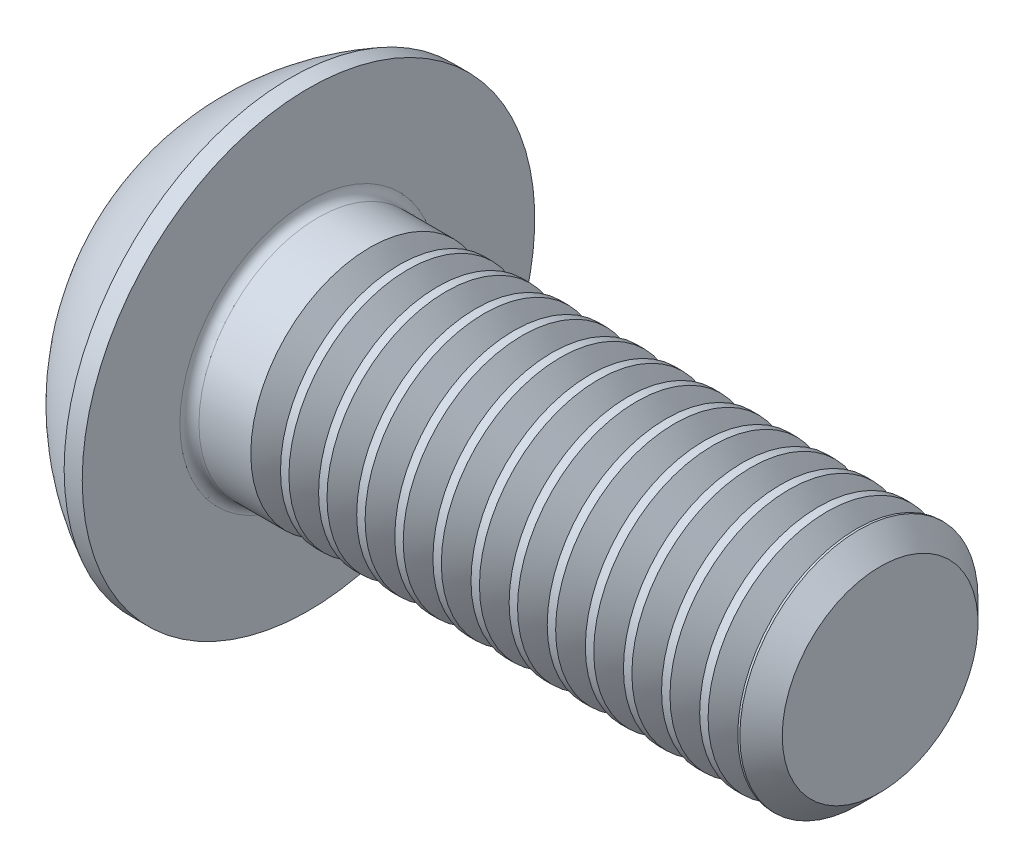
ISO-10303-21;
HEADER;
FILE_DESCRIPTION(('STEP AP214'),'2;1');
FILE_NAME('part.step','',(''),(''),'','','');
FILE_SCHEMA(('AUTOMOTIVE_DESIGN { 1 0 10303 214 1 1 1 1 }'));
ENDSEC;
DATA;
#1=APPLICATION_CONTEXT('core data for automotive mechanical design processes');
#2=APPLICATION_PROTOCOL_DEFINITION('international standard','automotive_design',2000,#1);
#3=PRODUCT_CONTEXT('',#1,'mechanical');
#4=PRODUCT('Part','Part','',(#3));
#5=PRODUCT_RELATED_PRODUCT_CATEGORY('part','',(#4));
#6=PRODUCT_DEFINITION_FORMATION('','',#4);
#7=PRODUCT_DEFINITION_CONTEXT('part definition',#1,'design');
#8=PRODUCT_DEFINITION('design','',#6,#7);
#9=PRODUCT_DEFINITION_SHAPE('','',#8);
#10=(LENGTH_UNIT() NAMED_UNIT(*) SI_UNIT(.MILLI.,.METRE.));
#11=(NAMED_UNIT(*) PLANE_ANGLE_UNIT() SI_UNIT($,.RADIAN.));
#12=(NAMED_UNIT(*) SI_UNIT($,.STERADIAN.) SOLID_ANGLE_UNIT());
#13=UNCERTAINTY_MEASURE_WITH_UNIT(LENGTH_MEASURE(1.E-05),#10,'distance_accuracy_value','');
#14=(GEOMETRIC_REPRESENTATION_CONTEXT(3) GLOBAL_UNCERTAINTY_ASSIGNED_CONTEXT((#13)) GLOBAL_UNIT_ASSIGNED_CONTEXT((#10,
#11,#12)) REPRESENTATION_CONTEXT('',''));
#15=CARTESIAN_POINT('',(0.,0.,0.));
#16=DIRECTION('',(0.,0.,1.));
#17=DIRECTION('',(1.,0.,0.));
#18=AXIS2_PLACEMENT_3D('',#15,#16,#17);
#19=CARTESIAN_POINT('',(0.,0.,0.));
#20=DIRECTION('',(-1.,0.,0.));
#21=DIRECTION('',(0.,0.,1.));
#22=AXIS2_PLACEMENT_3D('',#19,#20,#21);
#23=PLANE('',#22);
#24=CARTESIAN_POINT('',(0.,0.,0.));
#25=DIRECTION('',(-1.,0.,0.));
#26=DIRECTION('',(0.,0.,1.));
#27=AXIS2_PLACEMENT_3D('',#24,#25,#26);
#28=CIRCLE('',#27,2.375);
#29=CARTESIAN_POINT('',(0.,0.,2.375));
#30=VERTEX_POINT('',#29);
#31=EDGE_CURVE('E160',#30,#30,#28,.T.);
#32=ORIENTED_EDGE('',*,*,#31,.T.);
#33=EDGE_LOOP('',(#32));
#34=FACE_BOUND('',#33,.T.);
#35=DIRECTION('',(0.,-1.,0.));
#36=VECTOR('',#35,1.);
#37=CARTESIAN_POINT('',(0.,-0.866025403784438,1.5));
#38=LINE('',#37,#36);
#39=CARTESIAN_POINT('',(0.,0.866025403784439,1.5));
#40=VERTEX_POINT('',#39);
#41=CARTESIAN_POINT('',(0.,-0.866025403784438,1.5));
#42=VERTEX_POINT('',#41);
#43=EDGE_CURVE('E50',#40,#42,#38,.T.);
#44=ORIENTED_EDGE('',*,*,#43,.T.);
#45=DIRECTION('',(0.,-0.5,-0.866025403784439));
#46=VECTOR('',#45,1.);
#47=CARTESIAN_POINT('',(0.,-1.73205080756888,0.));
#48=LINE('',#47,#46);
#49=CARTESIAN_POINT('',(0.,-1.73205080756888,0.));
#50=VERTEX_POINT('',#49);
#51=EDGE_CURVE('E466',#42,#50,#48,.T.);
#52=ORIENTED_EDGE('',*,*,#51,.T.);
#53=DIRECTION('',(0.,0.5,-0.866025403784439));
#54=VECTOR('',#53,1.);
#55=CARTESIAN_POINT('',(0.,-0.866025403784438,-1.5));
#56=LINE('',#55,#54);
#57=CARTESIAN_POINT('',(0.,-0.866025403784438,-1.5));
#58=VERTEX_POINT('',#57);
#59=EDGE_CURVE('E135',#50,#58,#56,.T.);
#60=ORIENTED_EDGE('',*,*,#59,.T.);
#61=DIRECTION('',(0.,1.,0.));
#62=VECTOR('',#61,1.);
#63=CARTESIAN_POINT('',(0.,0.866025403784439,-1.5));
#64=LINE('',#63,#62);
#65=CARTESIAN_POINT('',(0.,0.866025403784439,-1.5));
#66=VERTEX_POINT('',#65);
#67=EDGE_CURVE('E484',#58,#66,#64,.T.);
#68=ORIENTED_EDGE('',*,*,#67,.T.);
#69=DIRECTION('',(0.,0.5,0.866025403784438));
#70=VECTOR('',#69,1.);
#71=CARTESIAN_POINT('',(0.,1.73205080756888,0.));
#72=LINE('',#71,#70);
#73=CARTESIAN_POINT('',(0.,1.73205080756888,0.));
#74=VERTEX_POINT('',#73);
#75=EDGE_CURVE('E486',#66,#74,#72,.T.);
#76=ORIENTED_EDGE('',*,*,#75,.T.);
#77=DIRECTION('',(0.,-0.5,0.866025403784438));
#78=VECTOR('',#77,1.);
#79=CARTESIAN_POINT('',(0.,0.866025403784439,1.5));
#80=LINE('',#79,#78);
#81=EDGE_CURVE('E488',#74,#40,#80,.T.);
#82=ORIENTED_EDGE('',*,*,#81,.T.);
#83=EDGE_LOOP('',(#44,#52,#60,#68,#76,#82));
#84=FACE_BOUND('',#83,.T.);
#85=ADVANCED_FACE('F35',(#34,#84),#23,.T.);
#86=CARTESIAN_POINT('',(4.75501582278481,0.,0.));
#87=DIRECTION('',(-1.,0.,0.));
#88=DIRECTION('',(0.,1.,0.));
#89=AXIS2_PLACEMENT_3D('',#86,#87,#88);
#90=SPHERICAL_SURFACE('',#89,5.3151482081814);
#91=CARTESIAN_POINT('',(2.37,0.,0.));
#92=DIRECTION('',(-1.,0.,0.));
#93=DIRECTION('',(0.,0.,1.));
#94=AXIS2_PLACEMENT_3D('',#91,#92,#93);
#95=CIRCLE('',#94,4.75);
#96=CARTESIAN_POINT('',(2.37,0.,4.75));
#97=VERTEX_POINT('',#96);
#98=EDGE_CURVE('E157',#97,#97,#95,.T.);
#99=ORIENTED_EDGE('',*,*,#98,.T.);
#100=EDGE_LOOP('',(#99));
#101=FACE_BOUND('',#100,.T.);
#102=ORIENTED_EDGE('',*,*,#31,.F.);
#103=EDGE_LOOP('',(#102));
#104=FACE_BOUND('',#103,.T.);
#105=ADVANCED_FACE('F182',(#101,#104),#90,.T.);
#106=CARTESIAN_POINT('',(0.,0.,0.));
#107=DIRECTION('',(-1.,0.,0.));
#108=DIRECTION('',(0.,0.,1.));
#109=AXIS2_PLACEMENT_3D('',#106,#107,#108);
#110=CYLINDRICAL_SURFACE('',#109,4.75);
#111=ORIENTED_EDGE('',*,*,#98,.F.);
#112=EDGE_LOOP('',(#111));
#113=FACE_BOUND('',#112,.T.);
#114=CARTESIAN_POINT('',(2.75,0.,0.));
#115=DIRECTION('',(-1.,0.,0.));
#116=DIRECTION('',(0.,0.,1.));
#117=AXIS2_PLACEMENT_3D('',#114,#115,#116);
#118=CIRCLE('',#117,4.75);
#119=CARTESIAN_POINT('',(2.75,0.,4.75));
#120=VERTEX_POINT('',#119);
#121=EDGE_CURVE('E154',#120,#120,#118,.T.);
#122=ORIENTED_EDGE('',*,*,#121,.T.);
#123=EDGE_LOOP('',(#122));
#124=FACE_BOUND('',#123,.T.);
#125=ADVANCED_FACE('F187',(#113,#124),#110,.T.);
#126=CARTESIAN_POINT('',(2.75,2.5,0.));
#127=DIRECTION('',(-1.,0.,0.));
#128=DIRECTION('',(0.,0.,1.));
#129=AXIS2_PLACEMENT_3D('',#126,#127,#128);
#130=PLANE('',#129);
#131=CARTESIAN_POINT('',(2.75,0.,0.));
#132=DIRECTION('',(-1.,0.,0.));
#133=DIRECTION('',(0.,0.,1.));
#134=AXIS2_PLACEMENT_3D('',#131,#132,#133);
#135=CIRCLE('',#134,2.7);
#136=CARTESIAN_POINT('',(2.75,0.,2.7));
#137=VERTEX_POINT('',#136);
#138=EDGE_CURVE('E43',#137,#137,#135,.T.);
#139=ORIENTED_EDGE('',*,*,#138,.T.);
#140=EDGE_LOOP('',(#139));
#141=FACE_BOUND('',#140,.T.);
#142=ORIENTED_EDGE('',*,*,#121,.F.);
#143=EDGE_LOOP('',(#142));
#144=FACE_BOUND('',#143,.T.);
#145=ADVANCED_FACE('F165',(#141,#144),#130,.F.);
#146=CARTESIAN_POINT('',(0.,0.,0.));
#147=DIRECTION('',(-1.,0.,0.));
#148=DIRECTION('',(0.,0.,1.));
#149=AXIS2_PLACEMENT_3D('',#146,#147,#148);
#150=CYLINDRICAL_SURFACE('',#149,2.5);
#151=CARTESIAN_POINT('',(4.03840764549667,0.,0.));
#152=DIRECTION('',(-1.,0.,0.));
#153=DIRECTION('',(0.,-1.,0.));
#154=AXIS2_PLACEMENT_3D('',#151,#152,#153);
#155=CIRCLE('',#154,2.5);
#156=CARTESIAN_POINT('',(4.03840764549667,-2.5,0.));
#157=VERTEX_POINT('',#156);
#158=EDGE_CURVE('E461',#157,#157,#155,.T.);
#159=ORIENTED_EDGE('',*,*,#158,.T.);
#160=EDGE_LOOP('',(#159));
#161=FACE_BOUND('',#160,.T.);
#162=CARTESIAN_POINT('',(2.95,0.,0.));
#163=DIRECTION('',(-1.,0.,0.));
#164=DIRECTION('',(0.,0.,1.));
#165=AXIS2_PLACEMENT_3D('',#162,#163,#164);
#166=CIRCLE('',#165,2.5);
#167=CARTESIAN_POINT('',(2.95,0.,2.5));
#168=VERTEX_POINT('',#167);
#169=EDGE_CURVE('E11',#168,#168,#166,.F.);
#170=ORIENTED_EDGE('',*,*,#169,.T.);
#171=EDGE_LOOP('',(#170));
#172=FACE_BOUND('',#171,.T.);
#173=ADVANCED_FACE('F169',(#161,#172),#150,.T.);
#174=CARTESIAN_POINT('',(2.95,0.,0.));
#175=DIRECTION('',(-1.,0.,0.));
#176=DIRECTION('',(0.,0.,1.));
#177=AXIS2_PLACEMENT_3D('',#174,#175,#176);
#178=TOROIDAL_SURFACE('',#177,2.7,0.2);
#179=ORIENTED_EDGE('',*,*,#169,.F.);
#180=EDGE_LOOP('',(#179));
#181=FACE_BOUND('',#180,.T.);
#182=ORIENTED_EDGE('',*,*,#138,.F.);
#183=EDGE_LOOP('',(#182));
#184=FACE_BOUND('',#183,.T.);
#185=ADVANCED_FACE('F37',(#181,#184),#178,.F.);
#186=CARTESIAN_POINT('',(1.56,-1.73205080756888,0.));
#187=DIRECTION('',(0.,0.866025403784438,-0.5));
#188=DIRECTION('',(0.,0.5,0.866025403784439));
#189=AXIS2_PLACEMENT_3D('',#186,#187,#188);
#190=PLANE('',#189);
#191=DIRECTION('',(0.,-0.5,-0.866025403784439));
#192=VECTOR('',#191,1.);
#193=CARTESIAN_POINT('',(1.56,-1.73205080756888,0.));
#194=LINE('',#193,#192);
#195=CARTESIAN_POINT('',(1.56,-0.866025403784438,1.5));
#196=VERTEX_POINT('',#195);
#197=CARTESIAN_POINT('',(1.56,-1.29903810567666,0.75));
#198=VERTEX_POINT('',#197);
#199=EDGE_CURVE('E118',#196,#198,#194,.T.);
#200=ORIENTED_EDGE('',*,*,#199,.T.);
#201=CARTESIAN_POINT('',(1.56,-1.73205080756888,0.));
#202=VERTEX_POINT('',#201);
#203=EDGE_CURVE('E111',#198,#202,#194,.T.);
#204=ORIENTED_EDGE('',*,*,#203,.T.);
#205=DIRECTION('',(-1.,0.,0.));
#206=VECTOR('',#205,1.);
#207=CARTESIAN_POINT('',(1.56,-1.73205080756888,0.));
#208=LINE('',#207,#206);
#209=EDGE_CURVE('E115',#202,#50,#208,.T.);
#210=ORIENTED_EDGE('',*,*,#209,.T.);
#211=ORIENTED_EDGE('',*,*,#51,.F.);
#212=DIRECTION('',(-1.,0.,0.));
#213=VECTOR('',#212,1.);
#214=CARTESIAN_POINT('',(1.56,-0.866025403784438,1.5));
#215=LINE('',#214,#213);
#216=EDGE_CURVE('E481',#196,#42,#215,.T.);
#217=ORIENTED_EDGE('',*,*,#216,.F.);
#218=EDGE_LOOP('',(#200,#204,#210,#211,#217));
#219=FACE_BOUND('',#218,.T.);
#220=ADVANCED_FACE('F113',(#219),#190,.T.);
#221=CARTESIAN_POINT('',(1.56,-0.866025403784438,-1.5));
#222=DIRECTION('',(0.,0.866025403784438,0.5));
#223=DIRECTION('',(0.,-0.5,0.866025403784439));
#224=AXIS2_PLACEMENT_3D('',#221,#222,#223);
#225=PLANE('',#224);
#226=DIRECTION('',(0.,0.5,-0.866025403784439));
#227=VECTOR('',#226,1.);
#228=CARTESIAN_POINT('',(1.56,-0.866025403784438,-1.5));
#229=LINE('',#228,#227);
#230=CARTESIAN_POINT('',(1.56,-1.29903810567666,-0.75));
#231=VERTEX_POINT('',#230);
#232=EDGE_CURVE('E123',#202,#231,#229,.T.);
#233=ORIENTED_EDGE('',*,*,#232,.T.);
#234=CARTESIAN_POINT('',(1.56,-0.866025403784438,-1.5));
#235=VERTEX_POINT('',#234);
#236=EDGE_CURVE('E130',#231,#235,#229,.T.);
#237=ORIENTED_EDGE('',*,*,#236,.T.);
#238=DIRECTION('',(-1.,0.,0.));
#239=VECTOR('',#238,1.);
#240=CARTESIAN_POINT('',(1.56,-0.866025403784438,-1.5));
#241=LINE('',#240,#239);
#242=EDGE_CURVE('E137',#235,#58,#241,.T.);
#243=ORIENTED_EDGE('',*,*,#242,.T.);
#244=ORIENTED_EDGE('',*,*,#59,.F.);
#245=ORIENTED_EDGE('',*,*,#209,.F.);
#246=EDGE_LOOP('',(#233,#237,#243,#244,#245));
#247=FACE_BOUND('',#246,.T.);
#248=ADVANCED_FACE('F133',(#247),#225,.T.);
#249=CARTESIAN_POINT('',(1.56,0.866025403784439,-1.5));
#250=DIRECTION('',(0.,0.,1.));
#251=DIRECTION('',(1.,0.,0.));
#252=AXIS2_PLACEMENT_3D('',#249,#250,#251);
#253=PLANE('',#252);
#254=DIRECTION('',(0.,1.,0.));
#255=VECTOR('',#254,1.);
#256=CARTESIAN_POINT('',(1.56,0.866025403784439,-1.5));
#257=LINE('',#256,#255);
#258=CARTESIAN_POINT('',(1.56,0.,-1.5));
#259=VERTEX_POINT('',#258);
#260=EDGE_CURVE('E468',#235,#259,#257,.T.);
#261=ORIENTED_EDGE('',*,*,#260,.T.);
#262=CARTESIAN_POINT('',(1.56,0.866025403784439,-1.5));
#263=VERTEX_POINT('',#262);
#264=EDGE_CURVE('E129',#259,#263,#257,.T.);
#265=ORIENTED_EDGE('',*,*,#264,.T.);
#266=DIRECTION('',(-1.,0.,0.));
#267=VECTOR('',#266,1.);
#268=CARTESIAN_POINT('',(1.56,0.866025403784439,-1.5));
#269=LINE('',#268,#267);
#270=EDGE_CURVE('E142',#263,#66,#269,.T.);
#271=ORIENTED_EDGE('',*,*,#270,.T.);
#272=ORIENTED_EDGE('',*,*,#67,.F.);
#273=ORIENTED_EDGE('',*,*,#242,.F.);
#274=EDGE_LOOP('',(#261,#265,#271,#272,#273));
#275=FACE_BOUND('',#274,.T.);
#276=ADVANCED_FACE('F213',(#275),#253,.T.);
#277=CARTESIAN_POINT('',(1.56,1.73205080756888,0.));
#278=DIRECTION('',(0.,-0.866025403784438,0.5));
#279=DIRECTION('',(0.,-0.5,-0.866025403784439));
#280=AXIS2_PLACEMENT_3D('',#277,#278,#279);
#281=PLANE('',#280);
#282=DIRECTION('',(0.,0.5,0.866025403784438));
#283=VECTOR('',#282,1.);
#284=CARTESIAN_POINT('',(1.56,1.73205080756888,0.));
#285=LINE('',#284,#283);
#286=CARTESIAN_POINT('',(1.56,1.29903810567666,-0.750000000000001));
#287=VERTEX_POINT('',#286);
#288=EDGE_CURVE('E472',#263,#287,#285,.T.);
#289=ORIENTED_EDGE('',*,*,#288,.T.);
#290=CARTESIAN_POINT('',(1.56,1.73205080756888,0.));
#291=VERTEX_POINT('',#290);
#292=EDGE_CURVE('E471',#287,#291,#285,.T.);
#293=ORIENTED_EDGE('',*,*,#292,.T.);
#294=DIRECTION('',(-1.,0.,0.));
#295=VECTOR('',#294,1.);
#296=CARTESIAN_POINT('',(1.56,1.73205080756888,0.));
#297=LINE('',#296,#295);
#298=EDGE_CURVE('E496',#291,#74,#297,.T.);
#299=ORIENTED_EDGE('',*,*,#298,.T.);
#300=ORIENTED_EDGE('',*,*,#75,.F.);
#301=ORIENTED_EDGE('',*,*,#270,.F.);
#302=EDGE_LOOP('',(#289,#293,#299,#300,#301));
#303=FACE_BOUND('',#302,.T.);
#304=ADVANCED_FACE('F216',(#303),#281,.T.);
#305=CARTESIAN_POINT('',(1.56,0.866025403784439,1.5));
#306=DIRECTION('',(0.,-0.866025403784438,-0.5));
#307=DIRECTION('',(0.,0.5,-0.866025403784439));
#308=AXIS2_PLACEMENT_3D('',#305,#306,#307);
#309=PLANE('',#308);
#310=DIRECTION('',(0.,-0.5,0.866025403784438));
#311=VECTOR('',#310,1.);
#312=CARTESIAN_POINT('',(1.56,0.866025403784439,1.5));
#313=LINE('',#312,#311);
#314=CARTESIAN_POINT('',(1.56,1.29903810567666,0.750000000000001));
#315=VERTEX_POINT('',#314);
#316=EDGE_CURVE('E476',#291,#315,#313,.T.);
#317=ORIENTED_EDGE('',*,*,#316,.T.);
#318=CARTESIAN_POINT('',(1.56,0.866025403784439,1.5));
#319=VERTEX_POINT('',#318);
#320=EDGE_CURVE('E475',#315,#319,#313,.T.);
#321=ORIENTED_EDGE('',*,*,#320,.T.);
#322=DIRECTION('',(-1.,0.,0.));
#323=VECTOR('',#322,1.);
#324=CARTESIAN_POINT('',(1.56,0.866025403784439,1.5));
#325=LINE('',#324,#323);
#326=EDGE_CURVE('E493',#319,#40,#325,.T.);
#327=ORIENTED_EDGE('',*,*,#326,.T.);
#328=ORIENTED_EDGE('',*,*,#81,.F.);
#329=ORIENTED_EDGE('',*,*,#298,.F.);
#330=EDGE_LOOP('',(#317,#321,#327,#328,#329));
#331=FACE_BOUND('',#330,.T.);
#332=ADVANCED_FACE('F220',(#331),#309,.T.);
#333=CARTESIAN_POINT('',(1.56,-0.866025403784438,1.5));
#334=DIRECTION('',(0.,0.,-1.));
#335=DIRECTION('',(-1.,0.,0.));
#336=AXIS2_PLACEMENT_3D('',#333,#334,#335);
#337=PLANE('',#336);
#338=DIRECTION('',(0.,-1.,0.));
#339=VECTOR('',#338,1.);
#340=CARTESIAN_POINT('',(1.56,-0.866025403784438,1.5));
#341=LINE('',#340,#339);
#342=CARTESIAN_POINT('',(1.56,0.,1.5));
#343=VERTEX_POINT('',#342);
#344=EDGE_CURVE('E58',#319,#343,#341,.T.);
#345=ORIENTED_EDGE('',*,*,#344,.T.);
#346=EDGE_CURVE('E479',#343,#196,#341,.T.);
#347=ORIENTED_EDGE('',*,*,#346,.T.);
#348=ORIENTED_EDGE('',*,*,#216,.T.);
#349=ORIENTED_EDGE('',*,*,#43,.F.);
#350=ORIENTED_EDGE('',*,*,#326,.F.);
#351=EDGE_LOOP('',(#345,#347,#348,#349,#350));
#352=FACE_BOUND('',#351,.T.);
#353=ADVANCED_FACE('F224',(#352),#337,.T.);
#354=CARTESIAN_POINT('',(1.56,0.,3.));
#355=DIRECTION('',(-1.,0.,0.));
#356=DIRECTION('',(0.,0.,1.));
#357=AXIS2_PLACEMENT_3D('',#354,#355,#356);
#358=PLANE('',#357);
#359=ORIENTED_EDGE('',*,*,#344,.F.);
#360=ORIENTED_EDGE('',*,*,#320,.F.);
#361=CARTESIAN_POINT('',(1.56,0.,0.));
#362=DIRECTION('',(-1.,0.,0.));
#363=DIRECTION('',(0.,0.,1.));
#364=AXIS2_PLACEMENT_3D('',#361,#362,#363);
#365=CIRCLE('',#364,1.5);
#366=EDGE_CURVE('E141',#343,#315,#365,.T.);
#367=ORIENTED_EDGE('',*,*,#366,.F.);
#368=EDGE_LOOP('',(#359,#360,#367));
#369=FACE_BOUND('',#368,.T.);
#370=ADVANCED_FACE('F228',(#369),#358,.T.);
#371=ORIENTED_EDGE('',*,*,#316,.F.);
#372=ORIENTED_EDGE('',*,*,#292,.F.);
#373=EDGE_CURVE('E148',#315,#287,#365,.T.);
#374=ORIENTED_EDGE('',*,*,#373,.F.);
#375=EDGE_LOOP('',(#371,#372,#374));
#376=FACE_BOUND('',#375,.T.);
#377=ADVANCED_FACE('F522',(#376),#358,.T.);
#378=ORIENTED_EDGE('',*,*,#288,.F.);
#379=ORIENTED_EDGE('',*,*,#264,.F.);
#380=EDGE_CURVE('E512',#287,#259,#365,.T.);
#381=ORIENTED_EDGE('',*,*,#380,.F.);
#382=EDGE_LOOP('',(#378,#379,#381));
#383=FACE_BOUND('',#382,.T.);
#384=ADVANCED_FACE('F514',(#383),#358,.T.);
#385=ORIENTED_EDGE('',*,*,#260,.F.);
#386=ORIENTED_EDGE('',*,*,#236,.F.);
#387=EDGE_CURVE('E511',#259,#231,#365,.T.);
#388=ORIENTED_EDGE('',*,*,#387,.F.);
#389=EDGE_LOOP('',(#385,#386,#388));
#390=FACE_BOUND('',#389,.T.);
#391=ADVANCED_FACE('F510',(#390),#358,.T.);
#392=ORIENTED_EDGE('',*,*,#232,.F.);
#393=ORIENTED_EDGE('',*,*,#203,.F.);
#394=EDGE_CURVE('E125',#231,#198,#365,.T.);
#395=ORIENTED_EDGE('',*,*,#394,.F.);
#396=EDGE_LOOP('',(#392,#393,#395));
#397=FACE_BOUND('',#396,.T.);
#398=ADVANCED_FACE('F124',(#397),#358,.T.);
#399=ORIENTED_EDGE('',*,*,#199,.F.);
#400=ORIENTED_EDGE('',*,*,#346,.F.);
#401=EDGE_CURVE('E136',#198,#343,#365,.T.);
#402=ORIENTED_EDGE('',*,*,#401,.F.);
#403=EDGE_LOOP('',(#399,#400,#402));
#404=FACE_BOUND('',#403,.T.);
#405=ADVANCED_FACE('F208',(#404),#358,.T.);
#406=CARTESIAN_POINT('',(2.42602540378445,0.,0.));
#407=DIRECTION('',(-1.,0.,0.));
#408=DIRECTION('',(0.,0.,1.));
#409=AXIS2_PLACEMENT_3D('',#406,#407,#408);
#410=CONICAL_SURFACE('',#409,0.,1.04719755119659);
#411=ORIENTED_EDGE('',*,*,#366,.T.);
#412=ORIENTED_EDGE('',*,*,#373,.T.);
#413=ORIENTED_EDGE('',*,*,#380,.T.);
#414=ORIENTED_EDGE('',*,*,#387,.T.);
#415=ORIENTED_EDGE('',*,*,#394,.T.);
#416=ORIENTED_EDGE('',*,*,#401,.T.);
#417=EDGE_LOOP('',(#411,#412,#413,#414,#415,#416));
#418=FACE_BOUND('',#417,.T.);
#419=CARTESIAN_POINT('',(2.42602540378445,0.,0.));
#420=VERTEX_POINT('',#419);
#421=VERTEX_LOOP('',#420);
#422=FACE_BOUND('',#421,.T.);
#423=ADVANCED_FACE('F205',(#418,#422),#410,.F.);
#424=CARTESIAN_POINT('',(4.66159235450332,0.,0.));
#425=DIRECTION('',(1.,0.,0.));
#426=DIRECTION('',(0.,1.,0.));
#427=AXIS2_PLACEMENT_3D('',#424,#425,#426);
#428=CONICAL_SURFACE('',#427,2.5,0.959931088596885);
#429=CARTESIAN_POINT('',(4.35,0.,0.));
#430=DIRECTION('',(-1.,0.,0.));
#431=DIRECTION('',(0.,-1.,0.));
#432=AXIS2_PLACEMENT_3D('',#429,#430,#431);
#433=CIRCLE('',#432,2.055);
#434=CARTESIAN_POINT('',(4.35,-2.055,0.));
#435=VERTEX_POINT('',#434);
#436=EDGE_CURVE('E458',#435,#435,#433,.T.);
#437=ORIENTED_EDGE('',*,*,#436,.F.);
#438=EDGE_LOOP('',(#437));
#439=FACE_BOUND('',#438,.T.);
#440=CARTESIAN_POINT('',(4.66159235450332,0.,0.));
#441=DIRECTION('',(-1.,0.,0.));
#442=DIRECTION('',(0.,-1.,0.));
#443=AXIS2_PLACEMENT_3D('',#440,#441,#442);
#444=CIRCLE('',#443,2.5);
#445=CARTESIAN_POINT('',(4.66159235450332,-2.5,0.));
#446=VERTEX_POINT('',#445);
#447=EDGE_CURVE('E464',#446,#446,#444,.T.);
#448=ORIENTED_EDGE('',*,*,#447,.T.);
#449=EDGE_LOOP('',(#448));
#450=FACE_BOUND('',#449,.T.);
#451=ADVANCED_FACE('F207',(#439,#450),#428,.T.);
#452=CARTESIAN_POINT('',(4.35,0.,0.));
#453=DIRECTION('',(-1.,0.,0.));
#454=DIRECTION('',(0.,-1.,0.));
#455=AXIS2_PLACEMENT_3D('',#452,#453,#454);
#456=CONICAL_SURFACE('',#455,2.055,0.959931088596875);
#457=ORIENTED_EDGE('',*,*,#158,.F.);
#458=EDGE_LOOP('',(#457));
#459=FACE_BOUND('',#458,.T.);
#460=ORIENTED_EDGE('',*,*,#436,.T.);
#461=EDGE_LOOP('',(#460));
#462=FACE_BOUND('',#461,.T.);
#463=ADVANCED_FACE('F234',(#459,#462),#456,.T.);
#464=CARTESIAN_POINT('',(4.83840764549667,0.,0.));
#465=DIRECTION('',(-1.,0.,0.));
#466=DIRECTION('',(0.,-1.,0.));
#467=AXIS2_PLACEMENT_3D('',#464,#465,#466);
#468=CIRCLE('',#467,2.5);
#469=CARTESIAN_POINT('',(4.83840764549667,-2.5,0.));
#470=VERTEX_POINT('',#469);
#471=EDGE_CURVE('E452',#470,#470,#468,.T.);
#472=ORIENTED_EDGE('',*,*,#471,.T.);
#473=EDGE_LOOP('',(#472));
#474=FACE_BOUND('',#473,.T.);
#475=ORIENTED_EDGE('',*,*,#447,.F.);
#476=EDGE_LOOP('',(#475));
#477=FACE_BOUND('',#476,.T.);
#478=ADVANCED_FACE('F179',(#474,#477),#150,.T.);
#479=CARTESIAN_POINT('',(5.46159235450332,0.,0.));
#480=DIRECTION('',(1.,0.,0.));
#481=DIRECTION('',(0.,1.,0.));
#482=AXIS2_PLACEMENT_3D('',#479,#480,#481);
#483=CONICAL_SURFACE('',#482,2.5,0.959931088596885);
#484=CARTESIAN_POINT('',(5.15,0.,0.));
#485=DIRECTION('',(-1.,0.,0.));
#486=DIRECTION('',(0.,-1.,0.));
#487=AXIS2_PLACEMENT_3D('',#484,#485,#486);
#488=CIRCLE('',#487,2.055);
#489=CARTESIAN_POINT('',(5.15,-2.055,0.));
#490=VERTEX_POINT('',#489);
#491=EDGE_CURVE('E449',#490,#490,#488,.T.);
#492=ORIENTED_EDGE('',*,*,#491,.F.);
#493=EDGE_LOOP('',(#492));
#494=FACE_BOUND('',#493,.T.);
#495=CARTESIAN_POINT('',(5.46159235450332,0.,0.));
#496=DIRECTION('',(-1.,0.,0.));
#497=DIRECTION('',(0.,-1.,0.));
#498=AXIS2_PLACEMENT_3D('',#495,#496,#497);
#499=CIRCLE('',#498,2.5);
#500=CARTESIAN_POINT('',(5.46159235450332,-2.5,0.));
#501=VERTEX_POINT('',#500);
#502=EDGE_CURVE('E455',#501,#501,#499,.T.);
#503=ORIENTED_EDGE('',*,*,#502,.T.);
#504=EDGE_LOOP('',(#503));
#505=FACE_BOUND('',#504,.T.);
#506=ADVANCED_FACE('F239',(#494,#505),#483,.T.);
#507=CARTESIAN_POINT('',(5.15,0.,0.));
#508=DIRECTION('',(-1.,0.,0.));
#509=DIRECTION('',(0.,-1.,0.));
#510=AXIS2_PLACEMENT_3D('',#507,#508,#509);
#511=CONICAL_SURFACE('',#510,2.055,0.959931088596875);
#512=ORIENTED_EDGE('',*,*,#471,.F.);
#513=EDGE_LOOP('',(#512));
#514=FACE_BOUND('',#513,.T.);
#515=ORIENTED_EDGE('',*,*,#491,.T.);
#516=EDGE_LOOP('',(#515));
#517=FACE_BOUND('',#516,.T.);
#518=ADVANCED_FACE('F242',(#514,#517),#511,.T.);
#519=CARTESIAN_POINT('',(5.63840764549667,0.,0.));
#520=DIRECTION('',(-1.,0.,0.));
#521=DIRECTION('',(0.,-1.,0.));
#522=AXIS2_PLACEMENT_3D('',#519,#520,#521);
#523=CIRCLE('',#522,2.5);
#524=CARTESIAN_POINT('',(5.63840764549667,-2.5,0.));
#525=VERTEX_POINT('',#524);
#526=EDGE_CURVE('E443',#525,#525,#523,.T.);
#527=ORIENTED_EDGE('',*,*,#526,.T.);
#528=EDGE_LOOP('',(#527));
#529=FACE_BOUND('',#528,.T.);
#530=ORIENTED_EDGE('',*,*,#502,.F.);
#531=EDGE_LOOP('',(#530));
#532=FACE_BOUND('',#531,.T.);
#533=ADVANCED_FACE('F246',(#529,#532),#150,.T.);
#534=CARTESIAN_POINT('',(6.26159235450332,0.,0.));
#535=DIRECTION('',(1.,0.,0.));
#536=DIRECTION('',(0.,1.,0.));
#537=AXIS2_PLACEMENT_3D('',#534,#535,#536);
#538=CONICAL_SURFACE('',#537,2.5,0.959931088596885);
#539=CARTESIAN_POINT('',(5.95,0.,0.));
#540=DIRECTION('',(-1.,0.,0.));
#541=DIRECTION('',(0.,-1.,0.));
#542=AXIS2_PLACEMENT_3D('',#539,#540,#541);
#543=CIRCLE('',#542,2.055);
#544=CARTESIAN_POINT('',(5.95,-2.055,0.));
#545=VERTEX_POINT('',#544);
#546=EDGE_CURVE('E440',#545,#545,#543,.T.);
#547=ORIENTED_EDGE('',*,*,#546,.F.);
#548=EDGE_LOOP('',(#547));
#549=FACE_BOUND('',#548,.T.);
#550=CARTESIAN_POINT('',(6.26159235450332,0.,0.));
#551=DIRECTION('',(-1.,0.,0.));
#552=DIRECTION('',(0.,-1.,0.));
#553=AXIS2_PLACEMENT_3D('',#550,#551,#552);
#554=CIRCLE('',#553,2.5);
#555=CARTESIAN_POINT('',(6.26159235450332,-2.5,0.));
#556=VERTEX_POINT('',#555);
#557=EDGE_CURVE('E446',#556,#556,#554,.T.);
#558=ORIENTED_EDGE('',*,*,#557,.T.);
#559=EDGE_LOOP('',(#558));
#560=FACE_BOUND('',#559,.T.);
#561=ADVANCED_FACE('F248',(#549,#560),#538,.T.);
#562=CARTESIAN_POINT('',(5.95,0.,0.));
#563=DIRECTION('',(-1.,0.,0.));
#564=DIRECTION('',(0.,-1.,0.));
#565=AXIS2_PLACEMENT_3D('',#562,#563,#564);
#566=CONICAL_SURFACE('',#565,2.055,0.959931088596875);
#567=ORIENTED_EDGE('',*,*,#526,.F.);
#568=EDGE_LOOP('',(#567));
#569=FACE_BOUND('',#568,.T.);
#570=ORIENTED_EDGE('',*,*,#546,.T.);
#571=EDGE_LOOP('',(#570));
#572=FACE_BOUND('',#571,.T.);
#573=ADVANCED_FACE('F251',(#569,#572),#566,.T.);
#574=CARTESIAN_POINT('',(6.43840764549667,0.,0.));
#575=DIRECTION('',(-1.,0.,0.));
#576=DIRECTION('',(0.,-1.,0.));
#577=AXIS2_PLACEMENT_3D('',#574,#575,#576);
#578=CIRCLE('',#577,2.5);
#579=CARTESIAN_POINT('',(6.43840764549667,-2.5,0.));
#580=VERTEX_POINT('',#579);
#581=EDGE_CURVE('E434',#580,#580,#578,.T.);
#582=ORIENTED_EDGE('',*,*,#581,.T.);
#583=EDGE_LOOP('',(#582));
#584=FACE_BOUND('',#583,.T.);
#585=ORIENTED_EDGE('',*,*,#557,.F.);
#586=EDGE_LOOP('',(#585));
#587=FACE_BOUND('',#586,.T.);
#588=ADVANCED_FACE('F255',(#584,#587),#150,.T.);
#589=CARTESIAN_POINT('',(7.06159235450332,0.,0.));
#590=DIRECTION('',(1.,0.,0.));
#591=DIRECTION('',(0.,1.,0.));
#592=AXIS2_PLACEMENT_3D('',#589,#590,#591);
#593=CONICAL_SURFACE('',#592,2.5,0.959931088596885);
#594=CARTESIAN_POINT('',(6.75,0.,0.));
#595=DIRECTION('',(-1.,0.,0.));
#596=DIRECTION('',(0.,-1.,0.));
#597=AXIS2_PLACEMENT_3D('',#594,#595,#596);
#598=CIRCLE('',#597,2.055);
#599=CARTESIAN_POINT('',(6.75,-2.055,0.));
#600=VERTEX_POINT('',#599);
#601=EDGE_CURVE('E431',#600,#600,#598,.T.);
#602=ORIENTED_EDGE('',*,*,#601,.F.);
#603=EDGE_LOOP('',(#602));
#604=FACE_BOUND('',#603,.T.);
#605=CARTESIAN_POINT('',(7.06159235450332,0.,0.));
#606=DIRECTION('',(-1.,0.,0.));
#607=DIRECTION('',(0.,-1.,0.));
#608=AXIS2_PLACEMENT_3D('',#605,#606,#607);
#609=CIRCLE('',#608,2.5);
#610=CARTESIAN_POINT('',(7.06159235450332,-2.5,0.));
#611=VERTEX_POINT('',#610);
#612=EDGE_CURVE('E437',#611,#611,#609,.T.);
#613=ORIENTED_EDGE('',*,*,#612,.T.);
#614=EDGE_LOOP('',(#613));
#615=FACE_BOUND('',#614,.T.);
#616=ADVANCED_FACE('F257',(#604,#615),#593,.T.);
#617=CARTESIAN_POINT('',(6.75,0.,0.));
#618=DIRECTION('',(-1.,0.,0.));
#619=DIRECTION('',(0.,-1.,0.));
#620=AXIS2_PLACEMENT_3D('',#617,#618,#619);
#621=CONICAL_SURFACE('',#620,2.055,0.959931088596875);
#622=ORIENTED_EDGE('',*,*,#581,.F.);
#623=EDGE_LOOP('',(#622));
#624=FACE_BOUND('',#623,.T.);
#625=ORIENTED_EDGE('',*,*,#601,.T.);
#626=EDGE_LOOP('',(#625));
#627=FACE_BOUND('',#626,.T.);
#628=ADVANCED_FACE('F260',(#624,#627),#621,.T.);
#629=CARTESIAN_POINT('',(7.23840764549667,0.,0.));
#630=DIRECTION('',(-1.,0.,0.));
#631=DIRECTION('',(0.,-1.,0.));
#632=AXIS2_PLACEMENT_3D('',#629,#630,#631);
#633=CIRCLE('',#632,2.5);
#634=CARTESIAN_POINT('',(7.23840764549667,-2.5,0.));
#635=VERTEX_POINT('',#634);
#636=EDGE_CURVE('E425',#635,#635,#633,.T.);
#637=ORIENTED_EDGE('',*,*,#636,.T.);
#638=EDGE_LOOP('',(#637));
#639=FACE_BOUND('',#638,.T.);
#640=ORIENTED_EDGE('',*,*,#612,.F.);
#641=EDGE_LOOP('',(#640));
#642=FACE_BOUND('',#641,.T.);
#643=ADVANCED_FACE('F264',(#639,#642),#150,.T.);
#644=CARTESIAN_POINT('',(7.86159235450332,0.,0.));
#645=DIRECTION('',(1.,0.,0.));
#646=DIRECTION('',(0.,1.,0.));
#647=AXIS2_PLACEMENT_3D('',#644,#645,#646);
#648=CONICAL_SURFACE('',#647,2.5,0.959931088596885);
#649=CARTESIAN_POINT('',(7.55,0.,0.));
#650=DIRECTION('',(-1.,0.,0.));
#651=DIRECTION('',(0.,-1.,0.));
#652=AXIS2_PLACEMENT_3D('',#649,#650,#651);
#653=CIRCLE('',#652,2.055);
#654=CARTESIAN_POINT('',(7.55,-2.055,0.));
#655=VERTEX_POINT('',#654);
#656=EDGE_CURVE('E422',#655,#655,#653,.T.);
#657=ORIENTED_EDGE('',*,*,#656,.F.);
#658=EDGE_LOOP('',(#657));
#659=FACE_BOUND('',#658,.T.);
#660=CARTESIAN_POINT('',(7.86159235450332,0.,0.));
#661=DIRECTION('',(-1.,0.,0.));
#662=DIRECTION('',(0.,-1.,0.));
#663=AXIS2_PLACEMENT_3D('',#660,#661,#662);
#664=CIRCLE('',#663,2.5);
#665=CARTESIAN_POINT('',(7.86159235450332,-2.5,0.));
#666=VERTEX_POINT('',#665);
#667=EDGE_CURVE('E428',#666,#666,#664,.T.);
#668=ORIENTED_EDGE('',*,*,#667,.T.);
#669=EDGE_LOOP('',(#668));
#670=FACE_BOUND('',#669,.T.);
#671=ADVANCED_FACE('F266',(#659,#670),#648,.T.);
#672=CARTESIAN_POINT('',(7.55,0.,0.));
#673=DIRECTION('',(-1.,0.,0.));
#674=DIRECTION('',(0.,-1.,0.));
#675=AXIS2_PLACEMENT_3D('',#672,#673,#674);
#676=CONICAL_SURFACE('',#675,2.055,0.959931088596875);
#677=ORIENTED_EDGE('',*,*,#636,.F.);
#678=EDGE_LOOP('',(#677));
#679=FACE_BOUND('',#678,.T.);
#680=ORIENTED_EDGE('',*,*,#656,.T.);
#681=EDGE_LOOP('',(#680));
#682=FACE_BOUND('',#681,.T.);
#683=ADVANCED_FACE('F269',(#679,#682),#676,.T.);
#684=CARTESIAN_POINT('',(8.03840764549667,0.,0.));
#685=DIRECTION('',(-1.,0.,0.));
#686=DIRECTION('',(0.,-1.,0.));
#687=AXIS2_PLACEMENT_3D('',#684,#685,#686);
#688=CIRCLE('',#687,2.5);
#689=CARTESIAN_POINT('',(8.03840764549667,-2.5,0.));
#690=VERTEX_POINT('',#689);
#691=EDGE_CURVE('E416',#690,#690,#688,.T.);
#692=ORIENTED_EDGE('',*,*,#691,.T.);
#693=EDGE_LOOP('',(#692));
#694=FACE_BOUND('',#693,.T.);
#695=ORIENTED_EDGE('',*,*,#667,.F.);
#696=EDGE_LOOP('',(#695));
#697=FACE_BOUND('',#696,.T.);
#698=ADVANCED_FACE('F273',(#694,#697),#150,.T.);
#699=CARTESIAN_POINT('',(8.66159235450332,0.,0.));
#700=DIRECTION('',(1.,0.,0.));
#701=DIRECTION('',(0.,1.,0.));
#702=AXIS2_PLACEMENT_3D('',#699,#700,#701);
#703=CONICAL_SURFACE('',#702,2.5,0.959931088596885);
#704=CARTESIAN_POINT('',(8.35,0.,0.));
#705=DIRECTION('',(-1.,0.,0.));
#706=DIRECTION('',(0.,-1.,0.));
#707=AXIS2_PLACEMENT_3D('',#704,#705,#706);
#708=CIRCLE('',#707,2.055);
#709=CARTESIAN_POINT('',(8.35,-2.055,0.));
#710=VERTEX_POINT('',#709);
#711=EDGE_CURVE('E413',#710,#710,#708,.T.);
#712=ORIENTED_EDGE('',*,*,#711,.F.);
#713=EDGE_LOOP('',(#712));
#714=FACE_BOUND('',#713,.T.);
#715=CARTESIAN_POINT('',(8.66159235450332,0.,0.));
#716=DIRECTION('',(-1.,0.,0.));
#717=DIRECTION('',(0.,-1.,0.));
#718=AXIS2_PLACEMENT_3D('',#715,#716,#717);
#719=CIRCLE('',#718,2.5);
#720=CARTESIAN_POINT('',(8.66159235450332,-2.5,0.));
#721=VERTEX_POINT('',#720);
#722=EDGE_CURVE('E419',#721,#721,#719,.T.);
#723=ORIENTED_EDGE('',*,*,#722,.T.);
#724=EDGE_LOOP('',(#723));
#725=FACE_BOUND('',#724,.T.);
#726=ADVANCED_FACE('F275',(#714,#725),#703,.T.);
#727=CARTESIAN_POINT('',(8.35,0.,0.));
#728=DIRECTION('',(-1.,0.,0.));
#729=DIRECTION('',(0.,-1.,0.));
#730=AXIS2_PLACEMENT_3D('',#727,#728,#729);
#731=CONICAL_SURFACE('',#730,2.055,0.959931088596875);
#732=ORIENTED_EDGE('',*,*,#691,.F.);
#733=EDGE_LOOP('',(#732));
#734=FACE_BOUND('',#733,.T.);
#735=ORIENTED_EDGE('',*,*,#711,.T.);
#736=EDGE_LOOP('',(#735));
#737=FACE_BOUND('',#736,.T.);
#738=ADVANCED_FACE('F278',(#734,#737),#731,.T.);
#739=CARTESIAN_POINT('',(8.83840764549667,0.,0.));
#740=DIRECTION('',(-1.,0.,0.));
#741=DIRECTION('',(0.,-1.,0.));
#742=AXIS2_PLACEMENT_3D('',#739,#740,#741);
#743=CIRCLE('',#742,2.5);
#744=CARTESIAN_POINT('',(8.83840764549667,-2.5,0.));
#745=VERTEX_POINT('',#744);
#746=EDGE_CURVE('E407',#745,#745,#743,.T.);
#747=ORIENTED_EDGE('',*,*,#746,.T.);
#748=EDGE_LOOP('',(#747));
#749=FACE_BOUND('',#748,.T.);
#750=ORIENTED_EDGE('',*,*,#722,.F.);
#751=EDGE_LOOP('',(#750));
#752=FACE_BOUND('',#751,.T.);
#753=ADVANCED_FACE('F282',(#749,#752),#150,.T.);
#754=CARTESIAN_POINT('',(9.46159235450332,0.,0.));
#755=DIRECTION('',(1.,0.,0.));
#756=DIRECTION('',(0.,1.,0.));
#757=AXIS2_PLACEMENT_3D('',#754,#755,#756);
#758=CONICAL_SURFACE('',#757,2.5,0.959931088596885);
#759=CARTESIAN_POINT('',(9.15,0.,0.));
#760=DIRECTION('',(-1.,0.,0.));
#761=DIRECTION('',(0.,-1.,0.));
#762=AXIS2_PLACEMENT_3D('',#759,#760,#761);
#763=CIRCLE('',#762,2.055);
#764=CARTESIAN_POINT('',(9.15,-2.055,0.));
#765=VERTEX_POINT('',#764);
#766=EDGE_CURVE('E404',#765,#765,#763,.T.);
#767=ORIENTED_EDGE('',*,*,#766,.F.);
#768=EDGE_LOOP('',(#767));
#769=FACE_BOUND('',#768,.T.);
#770=CARTESIAN_POINT('',(9.46159235450332,0.,0.));
#771=DIRECTION('',(-1.,0.,0.));
#772=DIRECTION('',(0.,-1.,0.));
#773=AXIS2_PLACEMENT_3D('',#770,#771,#772);
#774=CIRCLE('',#773,2.5);
#775=CARTESIAN_POINT('',(9.46159235450332,-2.5,0.));
#776=VERTEX_POINT('',#775);
#777=EDGE_CURVE('E410',#776,#776,#774,.T.);
#778=ORIENTED_EDGE('',*,*,#777,.T.);
#779=EDGE_LOOP('',(#778));
#780=FACE_BOUND('',#779,.T.);
#781=ADVANCED_FACE('F284',(#769,#780),#758,.T.);
#782=CARTESIAN_POINT('',(9.15,0.,0.));
#783=DIRECTION('',(-1.,0.,0.));
#784=DIRECTION('',(0.,-1.,0.));
#785=AXIS2_PLACEMENT_3D('',#782,#783,#784);
#786=CONICAL_SURFACE('',#785,2.055,0.959931088596875);
#787=ORIENTED_EDGE('',*,*,#746,.F.);
#788=EDGE_LOOP('',(#787));
#789=FACE_BOUND('',#788,.T.);
#790=ORIENTED_EDGE('',*,*,#766,.T.);
#791=EDGE_LOOP('',(#790));
#792=FACE_BOUND('',#791,.T.);
#793=ADVANCED_FACE('F287',(#789,#792),#786,.T.);
#794=CARTESIAN_POINT('',(9.63840764549668,0.,0.));
#795=DIRECTION('',(-1.,0.,0.));
#796=DIRECTION('',(0.,-1.,0.));
#797=AXIS2_PLACEMENT_3D('',#794,#795,#796);
#798=CIRCLE('',#797,2.5);
#799=CARTESIAN_POINT('',(9.63840764549668,-2.5,0.));
#800=VERTEX_POINT('',#799);
#801=EDGE_CURVE('E398',#800,#800,#798,.T.);
#802=ORIENTED_EDGE('',*,*,#801,.T.);
#803=EDGE_LOOP('',(#802));
#804=FACE_BOUND('',#803,.T.);
#805=ORIENTED_EDGE('',*,*,#777,.F.);
#806=EDGE_LOOP('',(#805));
#807=FACE_BOUND('',#806,.T.);
#808=ADVANCED_FACE('F291',(#804,#807),#150,.T.);
#809=CARTESIAN_POINT('',(10.2615923545033,0.,0.));
#810=DIRECTION('',(1.,0.,0.));
#811=DIRECTION('',(0.,1.,0.));
#812=AXIS2_PLACEMENT_3D('',#809,#810,#811);
#813=CONICAL_SURFACE('',#812,2.5,0.959931088596885);
#814=CARTESIAN_POINT('',(9.95,0.,0.));
#815=DIRECTION('',(-1.,0.,0.));
#816=DIRECTION('',(0.,-1.,0.));
#817=AXIS2_PLACEMENT_3D('',#814,#815,#816);
#818=CIRCLE('',#817,2.055);
#819=CARTESIAN_POINT('',(9.95,-2.055,0.));
#820=VERTEX_POINT('',#819);
#821=EDGE_CURVE('E395',#820,#820,#818,.T.);
#822=ORIENTED_EDGE('',*,*,#821,.F.);
#823=EDGE_LOOP('',(#822));
#824=FACE_BOUND('',#823,.T.);
#825=CARTESIAN_POINT('',(10.2615923545033,0.,0.));
#826=DIRECTION('',(-1.,0.,0.));
#827=DIRECTION('',(0.,-1.,0.));
#828=AXIS2_PLACEMENT_3D('',#825,#826,#827);
#829=CIRCLE('',#828,2.5);
#830=CARTESIAN_POINT('',(10.2615923545033,-2.5,0.));
#831=VERTEX_POINT('',#830);
#832=EDGE_CURVE('E401',#831,#831,#829,.T.);
#833=ORIENTED_EDGE('',*,*,#832,.T.);
#834=EDGE_LOOP('',(#833));
#835=FACE_BOUND('',#834,.T.);
#836=ADVANCED_FACE('F293',(#824,#835),#813,.T.);
#837=CARTESIAN_POINT('',(9.95,0.,0.));
#838=DIRECTION('',(-1.,0.,0.));
#839=DIRECTION('',(0.,-1.,0.));
#840=AXIS2_PLACEMENT_3D('',#837,#838,#839);
#841=CONICAL_SURFACE('',#840,2.055,0.959931088596875);
#842=ORIENTED_EDGE('',*,*,#801,.F.);
#843=EDGE_LOOP('',(#842));
#844=FACE_BOUND('',#843,.T.);
#845=ORIENTED_EDGE('',*,*,#821,.T.);
#846=EDGE_LOOP('',(#845));
#847=FACE_BOUND('',#846,.T.);
#848=ADVANCED_FACE('F296',(#844,#847),#841,.T.);
#849=CARTESIAN_POINT('',(10.4384076454967,0.,0.));
#850=DIRECTION('',(-1.,0.,0.));
#851=DIRECTION('',(0.,-1.,0.));
#852=AXIS2_PLACEMENT_3D('',#849,#850,#851);
#853=CIRCLE('',#852,2.5);
#854=CARTESIAN_POINT('',(10.4384076454967,-2.5,0.));
#855=VERTEX_POINT('',#854);
#856=EDGE_CURVE('E389',#855,#855,#853,.T.);
#857=ORIENTED_EDGE('',*,*,#856,.T.);
#858=EDGE_LOOP('',(#857));
#859=FACE_BOUND('',#858,.T.);
#860=ORIENTED_EDGE('',*,*,#832,.F.);
#861=EDGE_LOOP('',(#860));
#862=FACE_BOUND('',#861,.T.);
#863=ADVANCED_FACE('F300',(#859,#862),#150,.T.);
#864=CARTESIAN_POINT('',(11.0615923545033,0.,0.));
#865=DIRECTION('',(1.,0.,0.));
#866=DIRECTION('',(0.,1.,0.));
#867=AXIS2_PLACEMENT_3D('',#864,#865,#866);
#868=CONICAL_SURFACE('',#867,2.5,0.959931088596885);
#869=CARTESIAN_POINT('',(10.75,0.,0.));
#870=DIRECTION('',(-1.,0.,0.));
#871=DIRECTION('',(0.,-1.,0.));
#872=AXIS2_PLACEMENT_3D('',#869,#870,#871);
#873=CIRCLE('',#872,2.055);
#874=CARTESIAN_POINT('',(10.75,-2.055,0.));
#875=VERTEX_POINT('',#874);
#876=EDGE_CURVE('E386',#875,#875,#873,.T.);
#877=ORIENTED_EDGE('',*,*,#876,.F.);
#878=EDGE_LOOP('',(#877));
#879=FACE_BOUND('',#878,.T.);
#880=CARTESIAN_POINT('',(11.0615923545033,0.,0.));
#881=DIRECTION('',(-1.,0.,0.));
#882=DIRECTION('',(0.,-1.,0.));
#883=AXIS2_PLACEMENT_3D('',#880,#881,#882);
#884=CIRCLE('',#883,2.5);
#885=CARTESIAN_POINT('',(11.0615923545033,-2.5,0.));
#886=VERTEX_POINT('',#885);
#887=EDGE_CURVE('E392',#886,#886,#884,.T.);
#888=ORIENTED_EDGE('',*,*,#887,.T.);
#889=EDGE_LOOP('',(#888));
#890=FACE_BOUND('',#889,.T.);
#891=ADVANCED_FACE('F302',(#879,#890),#868,.T.);
#892=CARTESIAN_POINT('',(10.75,0.,0.));
#893=DIRECTION('',(-1.,0.,0.));
#894=DIRECTION('',(0.,-1.,0.));
#895=AXIS2_PLACEMENT_3D('',#892,#893,#894);
#896=CONICAL_SURFACE('',#895,2.055,0.959931088596875);
#897=ORIENTED_EDGE('',*,*,#856,.F.);
#898=EDGE_LOOP('',(#897));
#899=FACE_BOUND('',#898,.T.);
#900=ORIENTED_EDGE('',*,*,#876,.T.);
#901=EDGE_LOOP('',(#900));
#902=FACE_BOUND('',#901,.T.);
#903=ADVANCED_FACE('F305',(#899,#902),#896,.T.);
#904=CARTESIAN_POINT('',(11.2384076454967,0.,0.));
#905=DIRECTION('',(-1.,0.,0.));
#906=DIRECTION('',(0.,-1.,0.));
#907=AXIS2_PLACEMENT_3D('',#904,#905,#906);
#908=CIRCLE('',#907,2.5);
#909=CARTESIAN_POINT('',(11.2384076454967,-2.5,0.));
#910=VERTEX_POINT('',#909);
#911=EDGE_CURVE('E380',#910,#910,#908,.T.);
#912=ORIENTED_EDGE('',*,*,#911,.T.);
#913=EDGE_LOOP('',(#912));
#914=FACE_BOUND('',#913,.T.);
#915=ORIENTED_EDGE('',*,*,#887,.F.);
#916=EDGE_LOOP('',(#915));
#917=FACE_BOUND('',#916,.T.);
#918=ADVANCED_FACE('F309',(#914,#917),#150,.T.);
#919=CARTESIAN_POINT('',(11.8615923545033,0.,0.));
#920=DIRECTION('',(1.,0.,0.));
#921=DIRECTION('',(0.,1.,0.));
#922=AXIS2_PLACEMENT_3D('',#919,#920,#921);
#923=CONICAL_SURFACE('',#922,2.5,0.959931088596885);
#924=CARTESIAN_POINT('',(11.55,0.,0.));
#925=DIRECTION('',(-1.,0.,0.));
#926=DIRECTION('',(0.,-1.,0.));
#927=AXIS2_PLACEMENT_3D('',#924,#925,#926);
#928=CIRCLE('',#927,2.055);
#929=CARTESIAN_POINT('',(11.55,-2.055,0.));
#930=VERTEX_POINT('',#929);
#931=EDGE_CURVE('E377',#930,#930,#928,.T.);
#932=ORIENTED_EDGE('',*,*,#931,.F.);
#933=EDGE_LOOP('',(#932));
#934=FACE_BOUND('',#933,.T.);
#935=CARTESIAN_POINT('',(11.8615923545033,0.,0.));
#936=DIRECTION('',(-1.,0.,0.));
#937=DIRECTION('',(0.,-1.,0.));
#938=AXIS2_PLACEMENT_3D('',#935,#936,#937);
#939=CIRCLE('',#938,2.5);
#940=CARTESIAN_POINT('',(11.8615923545033,-2.5,0.));
#941=VERTEX_POINT('',#940);
#942=EDGE_CURVE('E383',#941,#941,#939,.T.);
#943=ORIENTED_EDGE('',*,*,#942,.T.);
#944=EDGE_LOOP('',(#943));
#945=FACE_BOUND('',#944,.T.);
#946=ADVANCED_FACE('F311',(#934,#945),#923,.T.);
#947=CARTESIAN_POINT('',(11.55,0.,0.));
#948=DIRECTION('',(-1.,0.,0.));
#949=DIRECTION('',(0.,-1.,0.));
#950=AXIS2_PLACEMENT_3D('',#947,#948,#949);
#951=CONICAL_SURFACE('',#950,2.055,0.959931088596875);
#952=ORIENTED_EDGE('',*,*,#911,.F.);
#953=EDGE_LOOP('',(#952));
#954=FACE_BOUND('',#953,.T.);
#955=ORIENTED_EDGE('',*,*,#931,.T.);
#956=EDGE_LOOP('',(#955));
#957=FACE_BOUND('',#956,.T.);
#958=ADVANCED_FACE('F314',(#954,#957),#951,.T.);
#959=CARTESIAN_POINT('',(12.0384076454967,0.,0.));
#960=DIRECTION('',(-1.,0.,0.));
#961=DIRECTION('',(0.,-1.,0.));
#962=AXIS2_PLACEMENT_3D('',#959,#960,#961);
#963=CIRCLE('',#962,2.5);
#964=CARTESIAN_POINT('',(12.0384076454967,-2.5,0.));
#965=VERTEX_POINT('',#964);
#966=EDGE_CURVE('E371',#965,#965,#963,.T.);
#967=ORIENTED_EDGE('',*,*,#966,.T.);
#968=EDGE_LOOP('',(#967));
#969=FACE_BOUND('',#968,.T.);
#970=ORIENTED_EDGE('',*,*,#942,.F.);
#971=EDGE_LOOP('',(#970));
#972=FACE_BOUND('',#971,.T.);
#973=ADVANCED_FACE('F318',(#969,#972),#150,.T.);
#974=CARTESIAN_POINT('',(12.6615923545033,0.,0.));
#975=DIRECTION('',(1.,0.,0.));
#976=DIRECTION('',(0.,1.,0.));
#977=AXIS2_PLACEMENT_3D('',#974,#975,#976);
#978=CONICAL_SURFACE('',#977,2.5,0.959931088596885);
#979=CARTESIAN_POINT('',(12.35,0.,0.));
#980=DIRECTION('',(-1.,0.,0.));
#981=DIRECTION('',(0.,-1.,0.));
#982=AXIS2_PLACEMENT_3D('',#979,#980,#981);
#983=CIRCLE('',#982,2.055);
#984=CARTESIAN_POINT('',(12.35,-2.055,0.));
#985=VERTEX_POINT('',#984);
#986=EDGE_CURVE('E368',#985,#985,#983,.T.);
#987=ORIENTED_EDGE('',*,*,#986,.F.);
#988=EDGE_LOOP('',(#987));
#989=FACE_BOUND('',#988,.T.);
#990=CARTESIAN_POINT('',(12.6615923545033,0.,0.));
#991=DIRECTION('',(-1.,0.,0.));
#992=DIRECTION('',(0.,-1.,0.));
#993=AXIS2_PLACEMENT_3D('',#990,#991,#992);
#994=CIRCLE('',#993,2.5);
#995=CARTESIAN_POINT('',(12.6615923545033,-2.5,0.));
#996=VERTEX_POINT('',#995);
#997=EDGE_CURVE('E374',#996,#996,#994,.T.);
#998=ORIENTED_EDGE('',*,*,#997,.T.);
#999=EDGE_LOOP('',(#998));
#1000=FACE_BOUND('',#999,.T.);
#1001=ADVANCED_FACE('F320',(#989,#1000),#978,.T.);
#1002=CARTESIAN_POINT('',(12.35,0.,0.));
#1003=DIRECTION('',(-1.,0.,0.));
#1004=DIRECTION('',(0.,-1.,0.));
#1005=AXIS2_PLACEMENT_3D('',#1002,#1003,#1004);
#1006=CONICAL_SURFACE('',#1005,2.055,0.959931088596875);
#1007=ORIENTED_EDGE('',*,*,#966,.F.);
#1008=EDGE_LOOP('',(#1007));
#1009=FACE_BOUND('',#1008,.T.);
#1010=ORIENTED_EDGE('',*,*,#986,.T.);
#1011=EDGE_LOOP('',(#1010));
#1012=FACE_BOUND('',#1011,.T.);
#1013=ADVANCED_FACE('F323',(#1009,#1012),#1006,.T.);
#1014=CARTESIAN_POINT('',(12.8384076454967,0.,0.));
#1015=DIRECTION('',(-1.,0.,0.));
#1016=DIRECTION('',(0.,-1.,0.));
#1017=AXIS2_PLACEMENT_3D('',#1014,#1015,#1016);
#1018=CIRCLE('',#1017,2.5);
#1019=CARTESIAN_POINT('',(12.8384076454967,-2.5,0.));
#1020=VERTEX_POINT('',#1019);
#1021=EDGE_CURVE('E362',#1020,#1020,#1018,.T.);
#1022=ORIENTED_EDGE('',*,*,#1021,.T.);
#1023=EDGE_LOOP('',(#1022));
#1024=FACE_BOUND('',#1023,.T.);
#1025=ORIENTED_EDGE('',*,*,#997,.F.);
#1026=EDGE_LOOP('',(#1025));
#1027=FACE_BOUND('',#1026,.T.);
#1028=ADVANCED_FACE('F327',(#1024,#1027),#150,.T.);
#1029=CARTESIAN_POINT('',(13.4615923545033,0.,0.));
#1030=DIRECTION('',(1.,0.,0.));
#1031=DIRECTION('',(0.,1.,0.));
#1032=AXIS2_PLACEMENT_3D('',#1029,#1030,#1031);
#1033=CONICAL_SURFACE('',#1032,2.5,0.959931088596885);
#1034=CARTESIAN_POINT('',(13.15,0.,0.));
#1035=DIRECTION('',(-1.,0.,0.));
#1036=DIRECTION('',(0.,-1.,0.));
#1037=AXIS2_PLACEMENT_3D('',#1034,#1035,#1036);
#1038=CIRCLE('',#1037,2.055);
#1039=CARTESIAN_POINT('',(13.15,-2.055,0.));
#1040=VERTEX_POINT('',#1039);
#1041=EDGE_CURVE('E359',#1040,#1040,#1038,.T.);
#1042=ORIENTED_EDGE('',*,*,#1041,.F.);
#1043=EDGE_LOOP('',(#1042));
#1044=FACE_BOUND('',#1043,.T.);
#1045=CARTESIAN_POINT('',(13.4615923545033,0.,0.));
#1046=DIRECTION('',(-1.,0.,0.));
#1047=DIRECTION('',(0.,-1.,0.));
#1048=AXIS2_PLACEMENT_3D('',#1045,#1046,#1047);
#1049=CIRCLE('',#1048,2.5);
#1050=CARTESIAN_POINT('',(13.4615923545033,-2.5,0.));
#1051=VERTEX_POINT('',#1050);
#1052=EDGE_CURVE('E365',#1051,#1051,#1049,.T.);
#1053=ORIENTED_EDGE('',*,*,#1052,.T.);
#1054=EDGE_LOOP('',(#1053));
#1055=FACE_BOUND('',#1054,.T.);
#1056=ADVANCED_FACE('F329',(#1044,#1055),#1033,.T.);
#1057=CARTESIAN_POINT('',(13.15,0.,0.));
#1058=DIRECTION('',(-1.,0.,0.));
#1059=DIRECTION('',(0.,-1.,0.));
#1060=AXIS2_PLACEMENT_3D('',#1057,#1058,#1059);
#1061=CONICAL_SURFACE('',#1060,2.055,0.959931088596875);
#1062=ORIENTED_EDGE('',*,*,#1021,.F.);
#1063=EDGE_LOOP('',(#1062));
#1064=FACE_BOUND('',#1063,.T.);
#1065=ORIENTED_EDGE('',*,*,#1041,.T.);
#1066=EDGE_LOOP('',(#1065));
#1067=FACE_BOUND('',#1066,.T.);
#1068=ADVANCED_FACE('F332',(#1064,#1067),#1061,.T.);
#1069=CARTESIAN_POINT('',(13.6384076454967,0.,0.));
#1070=DIRECTION('',(-1.,0.,0.));
#1071=DIRECTION('',(0.,-1.,0.));
#1072=AXIS2_PLACEMENT_3D('',#1069,#1070,#1071);
#1073=CIRCLE('',#1072,2.5);
#1074=CARTESIAN_POINT('',(13.6384076454967,-2.5,0.));
#1075=VERTEX_POINT('',#1074);
#1076=EDGE_CURVE('E349',#1075,#1075,#1073,.T.);
#1077=ORIENTED_EDGE('',*,*,#1076,.T.);
#1078=EDGE_LOOP('',(#1077));
#1079=FACE_BOUND('',#1078,.T.);
#1080=ORIENTED_EDGE('',*,*,#1052,.F.);
#1081=EDGE_LOOP('',(#1080));
#1082=FACE_BOUND('',#1081,.T.);
#1083=ADVANCED_FACE('F336',(#1079,#1082),#150,.T.);
#1084=CARTESIAN_POINT('',(14.2615923545033,0.,0.));
#1085=DIRECTION('',(1.,0.,0.));
#1086=DIRECTION('',(0.,1.,0.));
#1087=AXIS2_PLACEMENT_3D('',#1084,#1085,#1086);
#1088=CONICAL_SURFACE('',#1087,2.5,0.959931088596885);
#1089=CARTESIAN_POINT('',(13.95,0.,0.));
#1090=DIRECTION('',(-1.,0.,0.));
#1091=DIRECTION('',(0.,-1.,0.));
#1092=AXIS2_PLACEMENT_3D('',#1089,#1090,#1091);
#1093=CIRCLE('',#1092,2.055);
#1094=CARTESIAN_POINT('',(13.95,-2.055,0.));
#1095=VERTEX_POINT('',#1094);
#1096=EDGE_CURVE('E352',#1095,#1095,#1093,.T.);
#1097=ORIENTED_EDGE('',*,*,#1096,.F.);
#1098=EDGE_LOOP('',(#1097));
#1099=FACE_BOUND('',#1098,.T.);
#1100=CARTESIAN_POINT('',(14.2615923545033,0.,0.));
#1101=DIRECTION('',(-1.,0.,0.));
#1102=DIRECTION('',(0.,-1.,0.));
#1103=AXIS2_PLACEMENT_3D('',#1100,#1101,#1102);
#1104=CIRCLE('',#1103,2.5);
#1105=CARTESIAN_POINT('',(14.2615923545033,-2.5,0.));
#1106=VERTEX_POINT('',#1105);
#1107=EDGE_CURVE('E354',#1106,#1106,#1104,.T.);
#1108=ORIENTED_EDGE('',*,*,#1107,.T.);
#1109=EDGE_LOOP('',(#1108));
#1110=FACE_BOUND('',#1109,.T.);
#1111=ADVANCED_FACE('F338',(#1099,#1110),#1088,.T.);
#1112=CARTESIAN_POINT('',(13.95,0.,0.));
#1113=DIRECTION('',(-1.,0.,0.));
#1114=DIRECTION('',(0.,-1.,0.));
#1115=AXIS2_PLACEMENT_3D('',#1112,#1113,#1114);
#1116=CONICAL_SURFACE('',#1115,2.055,0.959931088596875);
#1117=ORIENTED_EDGE('',*,*,#1076,.F.);
#1118=EDGE_LOOP('',(#1117));
#1119=FACE_BOUND('',#1118,.T.);
#1120=ORIENTED_EDGE('',*,*,#1096,.T.);
#1121=EDGE_LOOP('',(#1120));
#1122=FACE_BOUND('',#1121,.T.);
#1123=ADVANCED_FACE('F203',(#1119,#1122),#1116,.T.);
#1124=CARTESIAN_POINT('',(14.75,0.,0.));
#1125=DIRECTION('',(-1.,0.,0.));
#1126=DIRECTION('',(0.,0.,1.));
#1127=AXIS2_PLACEMENT_3D('',#1124,#1125,#1126);
#1128=PLANE('',#1127);
#1129=CARTESIAN_POINT('',(14.75,0.,0.));
#1130=DIRECTION('',(-1.,0.,0.));
#1131=DIRECTION('',(0.,0.,1.));
#1132=AXIS2_PLACEMENT_3D('',#1129,#1130,#1131);
#1133=CIRCLE('',#1132,2.055);
#1134=CARTESIAN_POINT('',(14.75,0.,2.055));
#1135=VERTEX_POINT('',#1134);
#1136=EDGE_CURVE('E147',#1135,#1135,#1133,.T.);
#1137=ORIENTED_EDGE('',*,*,#1136,.F.);
#1138=EDGE_LOOP('',(#1137));
#1139=FACE_BOUND('',#1138,.T.);
#1140=ADVANCED_FACE('F199',(#1139),#1128,.F.);
#1141=CARTESIAN_POINT('',(14.75,0.,0.));
#1142=DIRECTION('',(-1.,0.,0.));
#1143=DIRECTION('',(0.,0.,1.));
#1144=AXIS2_PLACEMENT_3D('',#1141,#1142,#1143);
#1145=CONICAL_SURFACE('',#1144,2.055,0.785398163397442);
#1146=CARTESIAN_POINT('',(14.305,0.,0.));
#1147=DIRECTION('',(-1.,0.,0.));
#1148=DIRECTION('',(0.,0.,1.));
#1149=AXIS2_PLACEMENT_3D('',#1146,#1147,#1148);
#1150=CIRCLE('',#1149,2.5);
#1151=CARTESIAN_POINT('',(14.305,0.,2.5));
#1152=VERTEX_POINT('',#1151);
#1153=EDGE_CURVE('E151',#1152,#1152,#1150,.T.);
#1154=ORIENTED_EDGE('',*,*,#1153,.F.);
#1155=EDGE_LOOP('',(#1154));
#1156=FACE_BOUND('',#1155,.T.);
#1157=ORIENTED_EDGE('',*,*,#1136,.T.);
#1158=EDGE_LOOP('',(#1157));
#1159=FACE_BOUND('',#1158,.T.);
#1160=ADVANCED_FACE('F196',(#1156,#1159),#1145,.T.);
#1161=ORIENTED_EDGE('',*,*,#1107,.F.);
#1162=EDGE_LOOP('',(#1161));
#1163=FACE_BOUND('',#1162,.T.);
#1164=ORIENTED_EDGE('',*,*,#1153,.T.);
#1165=EDGE_LOOP('',(#1164));
#1166=FACE_BOUND('',#1165,.T.);
#1167=ADVANCED_FACE('F178',(#1163,#1166),#150,.T.);
#1168=CLOSED_SHELL('',(#85,#105,#125,#145,#173,#185,#220,#248,#276,#304,#332,#353,#370,#377,
#384,#391,#398,#405,#423,#451,#463,#478,#506,#518,#533,#561,#573,#588,#616,#628,#643,#671,#683,
#698,#726,#738,#753,#781,#793,#808,#836,#848,#863,#891,#903,#918,#946,#958,#973,#1001,#1013,
#1028,#1056,#1068,#1083,#1111,#1123,#1140,#1160,#1167));
#1169=MANIFOLD_SOLID_BREP('B2',#1168);
#1170=ADVANCED_BREP_SHAPE_REPRESENTATION('',(#18,#1169),#14);
#1171=SHAPE_DEFINITION_REPRESENTATION(#9,#1170);
ENDSEC;
END-ISO-10303-21;
